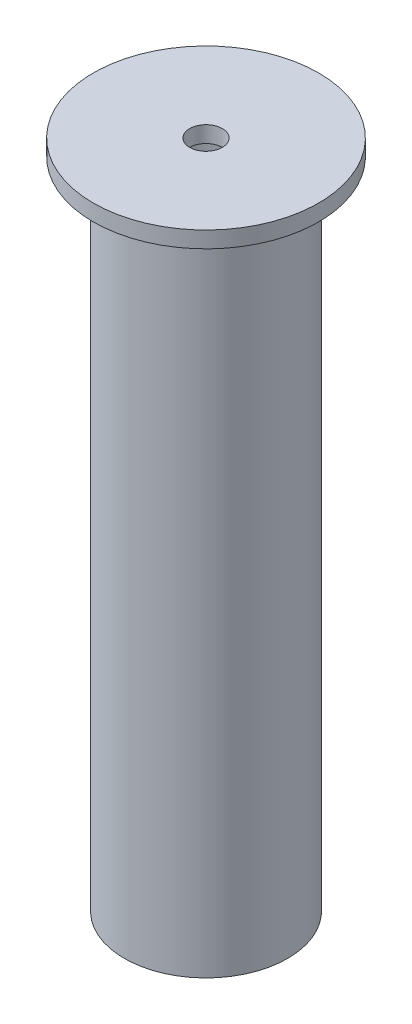
ISO-10303-21;
HEADER;
FILE_DESCRIPTION(('STEP AP214'),'2;1');
FILE_NAME('part.step','',(''),(''),'','','');
FILE_SCHEMA(('AUTOMOTIVE_DESIGN { 1 0 10303 214 1 1 1 1 }'));
ENDSEC;
DATA;
#1=APPLICATION_CONTEXT('core data for automotive mechanical design processes');
#2=APPLICATION_PROTOCOL_DEFINITION('international standard','automotive_design',2000,#1);
#3=PRODUCT_CONTEXT('',#1,'mechanical');
#4=PRODUCT('Part','Part','',(#3));
#5=PRODUCT_RELATED_PRODUCT_CATEGORY('part','',(#4));
#6=PRODUCT_DEFINITION_FORMATION('','',#4);
#7=PRODUCT_DEFINITION_CONTEXT('part definition',#1,'design');
#8=PRODUCT_DEFINITION('design','',#6,#7);
#9=PRODUCT_DEFINITION_SHAPE('','',#8);
#10=(LENGTH_UNIT() NAMED_UNIT(*) SI_UNIT(.MILLI.,.METRE.));
#11=(NAMED_UNIT(*) PLANE_ANGLE_UNIT() SI_UNIT($,.RADIAN.));
#12=(NAMED_UNIT(*) SI_UNIT($,.STERADIAN.) SOLID_ANGLE_UNIT());
#13=UNCERTAINTY_MEASURE_WITH_UNIT(LENGTH_MEASURE(1.E-05),#10,'distance_accuracy_value','');
#14=(GEOMETRIC_REPRESENTATION_CONTEXT(3) GLOBAL_UNCERTAINTY_ASSIGNED_CONTEXT((#13)) GLOBAL_UNIT_ASSIGNED_CONTEXT((#10,
#11,#12)) REPRESENTATION_CONTEXT('',''));
#15=CARTESIAN_POINT('',(0.,0.,0.));
#16=DIRECTION('',(0.,0.,1.));
#17=DIRECTION('',(1.,0.,0.));
#18=AXIS2_PLACEMENT_3D('',#15,#16,#17);
#19=CARTESIAN_POINT('',(0.,0.,0.));
#20=DIRECTION('',(0.,-1.,0.));
#21=DIRECTION('',(0.,0.,-1.));
#22=AXIS2_PLACEMENT_3D('',#19,#20,#21);
#23=CYLINDRICAL_SURFACE('',#22,10.);
#24=CARTESIAN_POINT('',(0.,400.,0.));
#25=DIRECTION('',(0.,-1.,0.));
#26=DIRECTION('',(0.,0.,-1.));
#27=AXIS2_PLACEMENT_3D('',#24,#25,#26);
#28=CIRCLE('',#27,10.);
#29=CARTESIAN_POINT('',(0.,400.,-10.));
#30=VERTEX_POINT('',#29);
#31=EDGE_CURVE('E67',#30,#30,#28,.T.);
#32=ORIENTED_EDGE('',*,*,#31,.T.);
#33=EDGE_LOOP('',(#32));
#34=FACE_BOUND('',#33,.T.);
#35=CARTESIAN_POINT('',(0.,410.,0.));
#36=DIRECTION('',(0.,-1.,0.));
#37=DIRECTION('',(0.,0.,-1.));
#38=AXIS2_PLACEMENT_3D('',#35,#36,#37);
#39=CIRCLE('',#38,10.);
#40=CARTESIAN_POINT('',(0.,410.,-10.));
#41=VERTEX_POINT('',#40);
#42=EDGE_CURVE('E10',#41,#41,#39,.T.);
#43=ORIENTED_EDGE('',*,*,#42,.F.);
#44=EDGE_LOOP('',(#43));
#45=FACE_BOUND('',#44,.T.);
#46=ADVANCED_FACE('F33',(#34,#45),#23,.F.);
#47=CARTESIAN_POINT('',(10.,410.,0.));
#48=DIRECTION('',(0.,1.,0.));
#49=DIRECTION('',(0.,0.,1.));
#50=AXIS2_PLACEMENT_3D('',#47,#48,#49);
#51=PLANE('',#50);
#52=ORIENTED_EDGE('',*,*,#42,.T.);
#53=EDGE_LOOP('',(#52));
#54=FACE_BOUND('',#53,.T.);
#55=CARTESIAN_POINT('',(0.,410.,0.));
#56=DIRECTION('',(0.,-1.,0.));
#57=DIRECTION('',(0.,0.,-1.));
#58=AXIS2_PLACEMENT_3D('',#55,#56,#57);
#59=CIRCLE('',#58,69.);
#60=CARTESIAN_POINT('',(0.,410.,-69.));
#61=VERTEX_POINT('',#60);
#62=EDGE_CURVE('E39',#61,#61,#59,.T.);
#63=ORIENTED_EDGE('',*,*,#62,.F.);
#64=EDGE_LOOP('',(#63));
#65=FACE_BOUND('',#64,.T.);
#66=ADVANCED_FACE('F85',(#54,#65),#51,.T.);
#67=CARTESIAN_POINT('',(0.,0.,0.));
#68=DIRECTION('',(0.,-1.,0.));
#69=DIRECTION('',(0.,0.,-1.));
#70=AXIS2_PLACEMENT_3D('',#67,#68,#69);
#71=CYLINDRICAL_SURFACE('',#70,69.);
#72=ORIENTED_EDGE('',*,*,#62,.T.);
#73=EDGE_LOOP('',(#72));
#74=FACE_BOUND('',#73,.T.);
#75=CARTESIAN_POINT('',(0.,400.,0.));
#76=DIRECTION('',(0.,-1.,0.));
#77=DIRECTION('',(0.,0.,-1.));
#78=AXIS2_PLACEMENT_3D('',#75,#76,#77);
#79=CIRCLE('',#78,69.);
#80=CARTESIAN_POINT('',(0.,400.,-69.));
#81=VERTEX_POINT('',#80);
#82=EDGE_CURVE('E43',#81,#81,#79,.T.);
#83=ORIENTED_EDGE('',*,*,#82,.F.);
#84=EDGE_LOOP('',(#83));
#85=FACE_BOUND('',#84,.T.);
#86=ADVANCED_FACE('F89',(#74,#85),#71,.T.);
#87=CARTESIAN_POINT('',(69.,400.,0.));
#88=DIRECTION('',(0.,-1.,0.));
#89=DIRECTION('',(0.,0.,-1.));
#90=AXIS2_PLACEMENT_3D('',#87,#88,#89);
#91=PLANE('',#90);
#92=ORIENTED_EDGE('',*,*,#82,.T.);
#93=EDGE_LOOP('',(#92));
#94=FACE_BOUND('',#93,.T.);
#95=CARTESIAN_POINT('',(0.,400.,0.));
#96=DIRECTION('',(0.,-1.,0.));
#97=DIRECTION('',(0.,0.,-1.));
#98=AXIS2_PLACEMENT_3D('',#95,#96,#97);
#99=CIRCLE('',#98,50.);
#100=CARTESIAN_POINT('',(0.,400.,-50.));
#101=VERTEX_POINT('',#100);
#102=EDGE_CURVE('E47',#101,#101,#99,.T.);
#103=ORIENTED_EDGE('',*,*,#102,.F.);
#104=EDGE_LOOP('',(#103));
#105=FACE_BOUND('',#104,.T.);
#106=ADVANCED_FACE('F93',(#94,#105),#91,.T.);
#107=CARTESIAN_POINT('',(0.,0.,0.));
#108=DIRECTION('',(0.,-1.,0.));
#109=DIRECTION('',(0.,0.,-1.));
#110=AXIS2_PLACEMENT_3D('',#107,#108,#109);
#111=CYLINDRICAL_SURFACE('',#110,50.);
#112=ORIENTED_EDGE('',*,*,#102,.T.);
#113=EDGE_LOOP('',(#112));
#114=FACE_BOUND('',#113,.T.);
#115=CARTESIAN_POINT('',(0.,0.,0.));
#116=DIRECTION('',(0.,-1.,0.));
#117=DIRECTION('',(0.,0.,-1.));
#118=AXIS2_PLACEMENT_3D('',#115,#116,#117);
#119=CIRCLE('',#118,50.0000000000001);
#120=CARTESIAN_POINT('',(0.,0.,-50.0000000000001));
#121=VERTEX_POINT('',#120);
#122=EDGE_CURVE('E52',#121,#121,#119,.T.);
#123=ORIENTED_EDGE('',*,*,#122,.F.);
#124=EDGE_LOOP('',(#123));
#125=FACE_BOUND('',#124,.T.);
#126=ADVANCED_FACE('F99',(#114,#125),#111,.T.);
#127=CARTESIAN_POINT('',(50.0000000000001,0.,0.));
#128=DIRECTION('',(0.,-1.,0.));
#129=DIRECTION('',(0.,0.,-1.));
#130=AXIS2_PLACEMENT_3D('',#127,#128,#129);
#131=PLANE('',#130);
#132=ORIENTED_EDGE('',*,*,#122,.T.);
#133=EDGE_LOOP('',(#132));
#134=FACE_BOUND('',#133,.T.);
#135=CARTESIAN_POINT('',(0.,0.,0.));
#136=DIRECTION('',(0.,-1.,0.));
#137=DIRECTION('',(0.,0.,-1.));
#138=AXIS2_PLACEMENT_3D('',#135,#136,#137);
#139=CIRCLE('',#138,38.0000000000001);
#140=CARTESIAN_POINT('',(0.,0.,-38.0000000000001));
#141=VERTEX_POINT('',#140);
#142=EDGE_CURVE('E55',#141,#141,#139,.T.);
#143=ORIENTED_EDGE('',*,*,#142,.F.);
#144=EDGE_LOOP('',(#143));
#145=FACE_BOUND('',#144,.T.);
#146=ADVANCED_FACE('F103',(#134,#145),#131,.T.);
#147=CARTESIAN_POINT('',(0.,0.,0.));
#148=DIRECTION('',(0.,-1.,0.));
#149=DIRECTION('',(0.,0.,-1.));
#150=AXIS2_PLACEMENT_3D('',#147,#148,#149);
#151=CYLINDRICAL_SURFACE('',#150,38.0000000000001);
#152=ORIENTED_EDGE('',*,*,#142,.T.);
#153=EDGE_LOOP('',(#152));
#154=FACE_BOUND('',#153,.T.);
#155=CARTESIAN_POINT('',(0.,10.,0.));
#156=DIRECTION('',(0.,-1.,0.));
#157=DIRECTION('',(0.,0.,-1.));
#158=AXIS2_PLACEMENT_3D('',#155,#156,#157);
#159=CIRCLE('',#158,38.0000000000001);
#160=CARTESIAN_POINT('',(0.,10.,-38.0000000000001));
#161=VERTEX_POINT('',#160);
#162=EDGE_CURVE('E58',#161,#161,#159,.T.);
#163=ORIENTED_EDGE('',*,*,#162,.F.);
#164=EDGE_LOOP('',(#163));
#165=FACE_BOUND('',#164,.T.);
#166=ADVANCED_FACE('F107',(#154,#165),#151,.F.);
#167=CARTESIAN_POINT('',(38.0000000000001,10.,0.));
#168=DIRECTION('',(0.,1.,0.));
#169=DIRECTION('',(0.,0.,1.));
#170=AXIS2_PLACEMENT_3D('',#167,#168,#169);
#171=PLANE('',#170);
#172=ORIENTED_EDGE('',*,*,#162,.T.);
#173=EDGE_LOOP('',(#172));
#174=FACE_BOUND('',#173,.T.);
#175=CARTESIAN_POINT('',(0.,10.,0.));
#176=DIRECTION('',(0.,-1.,0.));
#177=DIRECTION('',(0.,0.,-1.));
#178=AXIS2_PLACEMENT_3D('',#175,#176,#177);
#179=CIRCLE('',#178,44.0000000000001);
#180=CARTESIAN_POINT('',(0.,10.,-44.0000000000001));
#181=VERTEX_POINT('',#180);
#182=EDGE_CURVE('E61',#181,#181,#179,.T.);
#183=ORIENTED_EDGE('',*,*,#182,.F.);
#184=EDGE_LOOP('',(#183));
#185=FACE_BOUND('',#184,.T.);
#186=ADVANCED_FACE('F81',(#174,#185),#171,.T.);
#187=CARTESIAN_POINT('',(0.,0.,0.));
#188=DIRECTION('',(0.,-1.,0.));
#189=DIRECTION('',(0.,0.,-1.));
#190=AXIS2_PLACEMENT_3D('',#187,#188,#189);
#191=CYLINDRICAL_SURFACE('',#190,44.0000000000001);
#192=ORIENTED_EDGE('',*,*,#182,.T.);
#193=EDGE_LOOP('',(#192));
#194=FACE_BOUND('',#193,.T.);
#195=CARTESIAN_POINT('',(0.,400.,0.));
#196=DIRECTION('',(0.,-1.,0.));
#197=DIRECTION('',(0.,0.,-1.));
#198=AXIS2_PLACEMENT_3D('',#195,#196,#197);
#199=CIRCLE('',#198,44.0000000000001);
#200=CARTESIAN_POINT('',(0.,400.,-44.0000000000001));
#201=VERTEX_POINT('',#200);
#202=EDGE_CURVE('E64',#201,#201,#199,.T.);
#203=ORIENTED_EDGE('',*,*,#202,.F.);
#204=EDGE_LOOP('',(#203));
#205=FACE_BOUND('',#204,.T.);
#206=ADVANCED_FACE('F75',(#194,#205),#191,.F.);
#207=CARTESIAN_POINT('',(44.0000000000001,400.,0.));
#208=DIRECTION('',(0.,-1.,0.));
#209=DIRECTION('',(0.,0.,-1.));
#210=AXIS2_PLACEMENT_3D('',#207,#208,#209);
#211=PLANE('',#210);
#212=ORIENTED_EDGE('',*,*,#202,.T.);
#213=EDGE_LOOP('',(#212));
#214=FACE_BOUND('',#213,.T.);
#215=ORIENTED_EDGE('',*,*,#31,.F.);
#216=EDGE_LOOP('',(#215));
#217=FACE_BOUND('',#216,.T.);
#218=ADVANCED_FACE('F73',(#214,#217),#211,.T.);
#219=CLOSED_SHELL('',(#46,#66,#86,#106,#126,#146,#166,#186,#206,#218));
#220=MANIFOLD_SOLID_BREP('B2',#219);
#221=ADVANCED_BREP_SHAPE_REPRESENTATION('',(#18,#220),#14);
#222=SHAPE_DEFINITION_REPRESENTATION(#9,#221);
ENDSEC;
END-ISO-10303-21;
